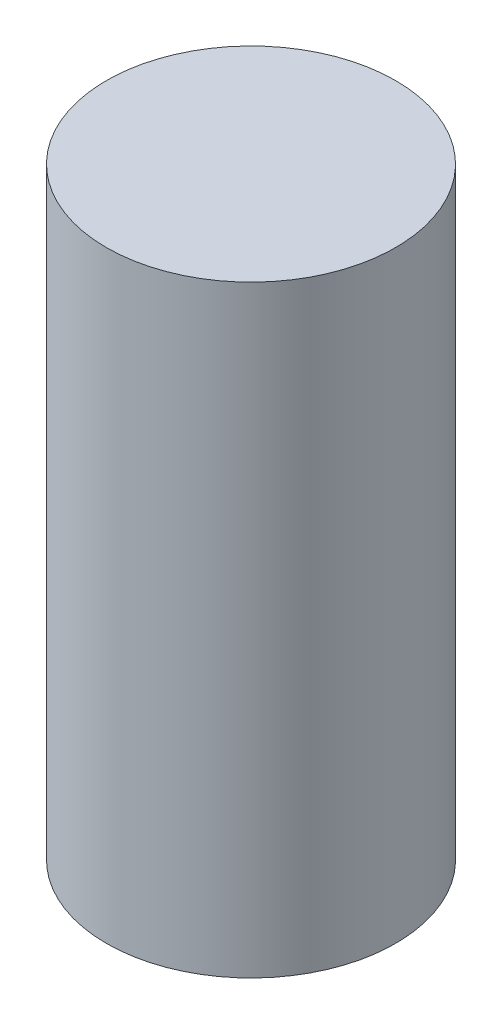
ISO-10303-21;
HEADER;
FILE_DESCRIPTION(('STEP AP214'),'2;1');
FILE_NAME('part.step','',(''),(''),'','','');
FILE_SCHEMA(('AUTOMOTIVE_DESIGN { 1 0 10303 214 1 1 1 1 }'));
ENDSEC;
DATA;
#1=APPLICATION_CONTEXT('core data for automotive mechanical design processes');
#2=APPLICATION_PROTOCOL_DEFINITION('international standard','automotive_design',2000,#1);
#3=PRODUCT_CONTEXT('',#1,'mechanical');
#4=PRODUCT('Part','Part','',(#3));
#5=PRODUCT_RELATED_PRODUCT_CATEGORY('part','',(#4));
#6=PRODUCT_DEFINITION_FORMATION('','',#4);
#7=PRODUCT_DEFINITION_CONTEXT('part definition',#1,'design');
#8=PRODUCT_DEFINITION('design','',#6,#7);
#9=PRODUCT_DEFINITION_SHAPE('','',#8);
#10=(LENGTH_UNIT() NAMED_UNIT(*) SI_UNIT(.MILLI.,.METRE.));
#11=(NAMED_UNIT(*) PLANE_ANGLE_UNIT() SI_UNIT($,.RADIAN.));
#12=(NAMED_UNIT(*) SI_UNIT($,.STERADIAN.) SOLID_ANGLE_UNIT());
#13=UNCERTAINTY_MEASURE_WITH_UNIT(LENGTH_MEASURE(1.E-05),#10,'distance_accuracy_value','');
#14=(GEOMETRIC_REPRESENTATION_CONTEXT(3) GLOBAL_UNCERTAINTY_ASSIGNED_CONTEXT((#13)) GLOBAL_UNIT_ASSIGNED_CONTEXT((#10,
#11,#12)) REPRESENTATION_CONTEXT('',''));
#15=CARTESIAN_POINT('',(0.,0.,0.));
#16=DIRECTION('',(0.,0.,1.));
#17=DIRECTION('',(1.,0.,0.));
#18=AXIS2_PLACEMENT_3D('',#15,#16,#17);
#19=CARTESIAN_POINT('',(0.,25.,0.));
#20=DIRECTION('',(0.,-1.,0.));
#21=DIRECTION('',(0.,0.,-1.));
#22=AXIS2_PLACEMENT_3D('',#19,#20,#21);
#23=CYLINDRICAL_SURFACE('',#22,6.);
#24=CARTESIAN_POINT('',(0.,25.,0.));
#25=DIRECTION('',(0.,1.,0.));
#26=DIRECTION('',(0.,0.,1.));
#27=AXIS2_PLACEMENT_3D('',#24,#25,#26);
#28=CIRCLE('',#27,6.);
#29=CARTESIAN_POINT('',(0.,25.,6.));
#30=VERTEX_POINT('',#29);
#31=EDGE_CURVE('E10',#30,#30,#28,.T.);
#32=ORIENTED_EDGE('',*,*,#31,.F.);
#33=EDGE_LOOP('',(#32));
#34=FACE_BOUND('',#33,.T.);
#35=CARTESIAN_POINT('',(0.,0.,0.));
#36=DIRECTION('',(0.,1.,0.));
#37=DIRECTION('',(0.,0.,1.));
#38=AXIS2_PLACEMENT_3D('',#35,#36,#37);
#39=CIRCLE('',#38,6.);
#40=CARTESIAN_POINT('',(0.,0.,6.));
#41=VERTEX_POINT('',#40);
#42=EDGE_CURVE('E32',#41,#41,#39,.T.);
#43=ORIENTED_EDGE('',*,*,#42,.T.);
#44=EDGE_LOOP('',(#43));
#45=FACE_BOUND('',#44,.T.);
#46=ADVANCED_FACE('F29',(#34,#45),#23,.T.);
#47=CARTESIAN_POINT('',(0.,25.,0.));
#48=DIRECTION('',(0.,1.,0.));
#49=DIRECTION('',(0.,0.,1.));
#50=AXIS2_PLACEMENT_3D('',#47,#48,#49);
#51=PLANE('',#50);
#52=ORIENTED_EDGE('',*,*,#31,.T.);
#53=EDGE_LOOP('',(#52));
#54=FACE_BOUND('',#53,.T.);
#55=ADVANCED_FACE('F44',(#54),#51,.T.);
#56=CARTESIAN_POINT('',(0.,0.,0.));
#57=DIRECTION('',(0.,1.,0.));
#58=DIRECTION('',(0.,0.,1.));
#59=AXIS2_PLACEMENT_3D('',#56,#57,#58);
#60=PLANE('',#59);
#61=ORIENTED_EDGE('',*,*,#42,.F.);
#62=EDGE_LOOP('',(#61));
#63=FACE_BOUND('',#62,.T.);
#64=ADVANCED_FACE('F42',(#63),#60,.F.);
#65=CLOSED_SHELL('',(#46,#55,#64));
#66=MANIFOLD_SOLID_BREP('B2',#65);
#67=ADVANCED_BREP_SHAPE_REPRESENTATION('',(#18,#66),#14);
#68=SHAPE_DEFINITION_REPRESENTATION(#9,#67);
ENDSEC;
END-ISO-10303-21;
